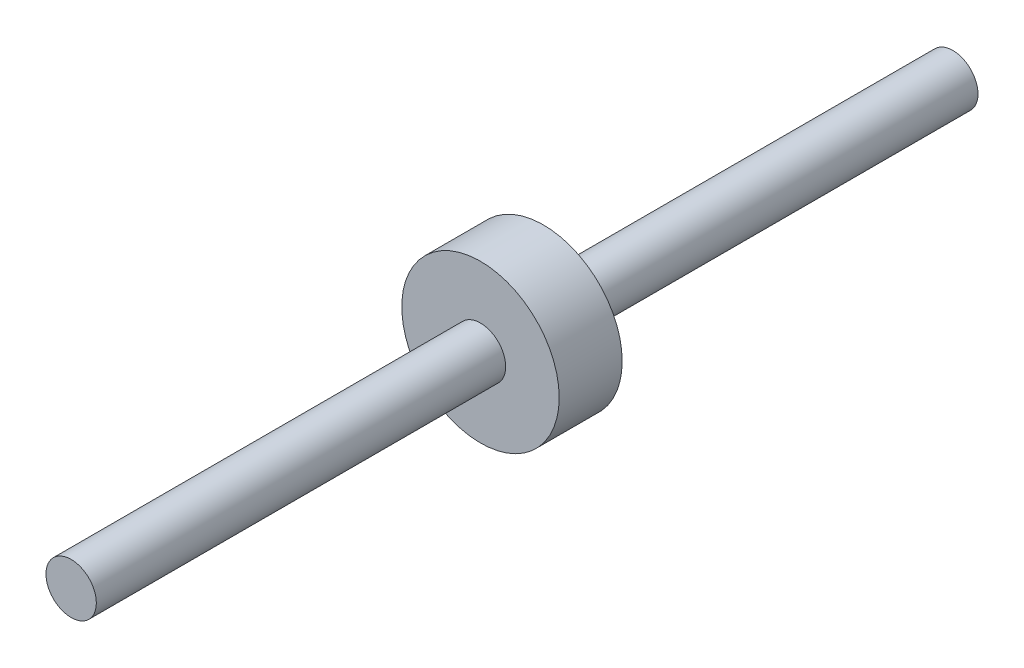
ISO-10303-21;
HEADER;
FILE_DESCRIPTION(('STEP AP214'),'2;1');
FILE_NAME('part.step','',(''),(''),'','','');
FILE_SCHEMA(('AUTOMOTIVE_DESIGN { 1 0 10303 214 1 1 1 1 }'));
ENDSEC;
DATA;
#1=APPLICATION_CONTEXT('core data for automotive mechanical design processes');
#2=APPLICATION_PROTOCOL_DEFINITION('international standard','automotive_design',2000,#1);
#3=PRODUCT_CONTEXT('',#1,'mechanical');
#4=PRODUCT('Part','Part','',(#3));
#5=PRODUCT_RELATED_PRODUCT_CATEGORY('part','',(#4));
#6=PRODUCT_DEFINITION_FORMATION('','',#4);
#7=PRODUCT_DEFINITION_CONTEXT('part definition',#1,'design');
#8=PRODUCT_DEFINITION('design','',#6,#7);
#9=PRODUCT_DEFINITION_SHAPE('','',#8);
#10=(LENGTH_UNIT() NAMED_UNIT(*) SI_UNIT(.MILLI.,.METRE.));
#11=(NAMED_UNIT(*) PLANE_ANGLE_UNIT() SI_UNIT($,.RADIAN.));
#12=(NAMED_UNIT(*) SI_UNIT($,.STERADIAN.) SOLID_ANGLE_UNIT());
#13=UNCERTAINTY_MEASURE_WITH_UNIT(LENGTH_MEASURE(1.E-05),#10,'distance_accuracy_value','');
#14=(GEOMETRIC_REPRESENTATION_CONTEXT(3) GLOBAL_UNCERTAINTY_ASSIGNED_CONTEXT((#13)) GLOBAL_UNIT_ASSIGNED_CONTEXT((#10,
#11,#12)) REPRESENTATION_CONTEXT('',''));
#15=CARTESIAN_POINT('',(0.,0.,0.));
#16=DIRECTION('',(0.,0.,1.));
#17=DIRECTION('',(1.,0.,0.));
#18=AXIS2_PLACEMENT_3D('',#15,#16,#17);
#19=CARTESIAN_POINT('',(0.,0.,0.));
#20=DIRECTION('',(0.,0.,1.));
#21=DIRECTION('',(1.,0.,0.));
#22=AXIS2_PLACEMENT_3D('',#19,#20,#21);
#23=CYLINDRICAL_SURFACE('',#22,12.5);
#24=CARTESIAN_POINT('',(0.,0.,-65.));
#25=DIRECTION('',(0.,0.,1.));
#26=DIRECTION('',(1.,0.,0.));
#27=AXIS2_PLACEMENT_3D('',#24,#25,#26);
#28=CIRCLE('',#27,12.5);
#29=CARTESIAN_POINT('',(12.5,0.,-65.));
#30=VERTEX_POINT('',#29);
#31=EDGE_CURVE('E10',#30,#30,#28,.T.);
#32=ORIENTED_EDGE('',*,*,#31,.F.);
#33=EDGE_LOOP('',(#32));
#34=FACE_BOUND('',#33,.T.);
#35=CARTESIAN_POINT('',(0.,0.,-75.));
#36=DIRECTION('',(0.,0.,1.));
#37=DIRECTION('',(1.,0.,0.));
#38=AXIS2_PLACEMENT_3D('',#35,#36,#37);
#39=CIRCLE('',#38,12.5);
#40=CARTESIAN_POINT('',(12.5,0.,-75.));
#41=VERTEX_POINT('',#40);
#42=EDGE_CURVE('E54',#41,#41,#39,.T.);
#43=ORIENTED_EDGE('',*,*,#42,.T.);
#44=EDGE_LOOP('',(#43));
#45=FACE_BOUND('',#44,.T.);
#46=ADVANCED_FACE('F32',(#34,#45),#23,.T.);
#47=CARTESIAN_POINT('',(0.,0.,-65.));
#48=DIRECTION('',(0.,0.,-1.));
#49=DIRECTION('',(-1.,0.,0.));
#50=AXIS2_PLACEMENT_3D('',#47,#48,#49);
#51=PLANE('',#50);
#52=CARTESIAN_POINT('',(0.,0.,-65.));
#53=DIRECTION('',(0.,0.,1.));
#54=DIRECTION('',(1.,0.,0.));
#55=AXIS2_PLACEMENT_3D('',#52,#53,#54);
#56=CIRCLE('',#55,4.);
#57=CARTESIAN_POINT('',(4.,0.,-65.));
#58=VERTEX_POINT('',#57);
#59=EDGE_CURVE('E38',#58,#58,#56,.T.);
#60=ORIENTED_EDGE('',*,*,#59,.F.);
#61=EDGE_LOOP('',(#60));
#62=FACE_BOUND('',#61,.T.);
#63=ORIENTED_EDGE('',*,*,#31,.T.);
#64=EDGE_LOOP('',(#63));
#65=FACE_BOUND('',#64,.T.);
#66=ADVANCED_FACE('F71',(#62,#65),#51,.F.);
#67=CARTESIAN_POINT('',(0.,0.,0.));
#68=DIRECTION('',(0.,0.,1.));
#69=DIRECTION('',(1.,0.,0.));
#70=AXIS2_PLACEMENT_3D('',#67,#68,#69);
#71=CYLINDRICAL_SURFACE('',#70,4.);
#72=ORIENTED_EDGE('',*,*,#59,.T.);
#73=EDGE_LOOP('',(#72));
#74=FACE_BOUND('',#73,.T.);
#75=CARTESIAN_POINT('',(0.,0.,0.));
#76=DIRECTION('',(0.,0.,1.));
#77=DIRECTION('',(1.,0.,0.));
#78=AXIS2_PLACEMENT_3D('',#75,#76,#77);
#79=CIRCLE('',#78,4.);
#80=CARTESIAN_POINT('',(4.,0.,0.));
#81=VERTEX_POINT('',#80);
#82=EDGE_CURVE('E42',#81,#81,#79,.T.);
#83=ORIENTED_EDGE('',*,*,#82,.F.);
#84=EDGE_LOOP('',(#83));
#85=FACE_BOUND('',#84,.T.);
#86=ADVANCED_FACE('F76',(#74,#85),#71,.T.);
#87=CARTESIAN_POINT('',(0.,0.,0.));
#88=DIRECTION('',(0.,0.,1.));
#89=DIRECTION('',(1.,0.,0.));
#90=AXIS2_PLACEMENT_3D('',#87,#88,#89);
#91=PLANE('',#90);
#92=ORIENTED_EDGE('',*,*,#82,.T.);
#93=EDGE_LOOP('',(#92));
#94=FACE_BOUND('',#93,.T.);
#95=ADVANCED_FACE('F81',(#94),#91,.T.);
#96=CARTESIAN_POINT('',(0.,0.,-140.));
#97=DIRECTION('',(0.,0.,1.));
#98=DIRECTION('',(1.,0.,0.));
#99=AXIS2_PLACEMENT_3D('',#96,#97,#98);
#100=PLANE('',#99);
#101=CARTESIAN_POINT('',(0.,0.,-140.));
#102=DIRECTION('',(0.,0.,1.));
#103=DIRECTION('',(1.,0.,0.));
#104=AXIS2_PLACEMENT_3D('',#101,#102,#103);
#105=CIRCLE('',#104,4.);
#106=CARTESIAN_POINT('',(4.,0.,-140.));
#107=VERTEX_POINT('',#106);
#108=EDGE_CURVE('E46',#107,#107,#105,.T.);
#109=ORIENTED_EDGE('',*,*,#108,.F.);
#110=EDGE_LOOP('',(#109));
#111=FACE_BOUND('',#110,.T.);
#112=ADVANCED_FACE('F67',(#111),#100,.F.);
#113=CARTESIAN_POINT('',(0.,0.,0.));
#114=DIRECTION('',(0.,0.,1.));
#115=DIRECTION('',(1.,0.,0.));
#116=AXIS2_PLACEMENT_3D('',#113,#114,#115);
#117=CYLINDRICAL_SURFACE('',#116,4.);
#118=ORIENTED_EDGE('',*,*,#108,.T.);
#119=EDGE_LOOP('',(#118));
#120=FACE_BOUND('',#119,.T.);
#121=CARTESIAN_POINT('',(0.,0.,-75.));
#122=DIRECTION('',(0.,0.,1.));
#123=DIRECTION('',(1.,0.,0.));
#124=AXIS2_PLACEMENT_3D('',#121,#122,#123);
#125=CIRCLE('',#124,4.);
#126=CARTESIAN_POINT('',(4.,0.,-75.));
#127=VERTEX_POINT('',#126);
#128=EDGE_CURVE('E51',#127,#127,#125,.T.);
#129=ORIENTED_EDGE('',*,*,#128,.F.);
#130=EDGE_LOOP('',(#129));
#131=FACE_BOUND('',#130,.T.);
#132=ADVANCED_FACE('F61',(#120,#131),#117,.T.);
#133=CARTESIAN_POINT('',(0.,0.,-75.));
#134=DIRECTION('',(0.,0.,-1.));
#135=DIRECTION('',(-1.,0.,0.));
#136=AXIS2_PLACEMENT_3D('',#133,#134,#135);
#137=PLANE('',#136);
#138=ORIENTED_EDGE('',*,*,#128,.T.);
#139=EDGE_LOOP('',(#138));
#140=FACE_BOUND('',#139,.T.);
#141=ORIENTED_EDGE('',*,*,#42,.F.);
#142=EDGE_LOOP('',(#141));
#143=FACE_BOUND('',#142,.T.);
#144=ADVANCED_FACE('F59',(#140,#143),#137,.T.);
#145=CLOSED_SHELL('',(#46,#66,#86,#95,#112,#132,#144));
#146=MANIFOLD_SOLID_BREP('B2',#145);
#147=ADVANCED_BREP_SHAPE_REPRESENTATION('',(#18,#146),#14);
#148=SHAPE_DEFINITION_REPRESENTATION(#9,#147);
ENDSEC;
END-ISO-10303-21;
